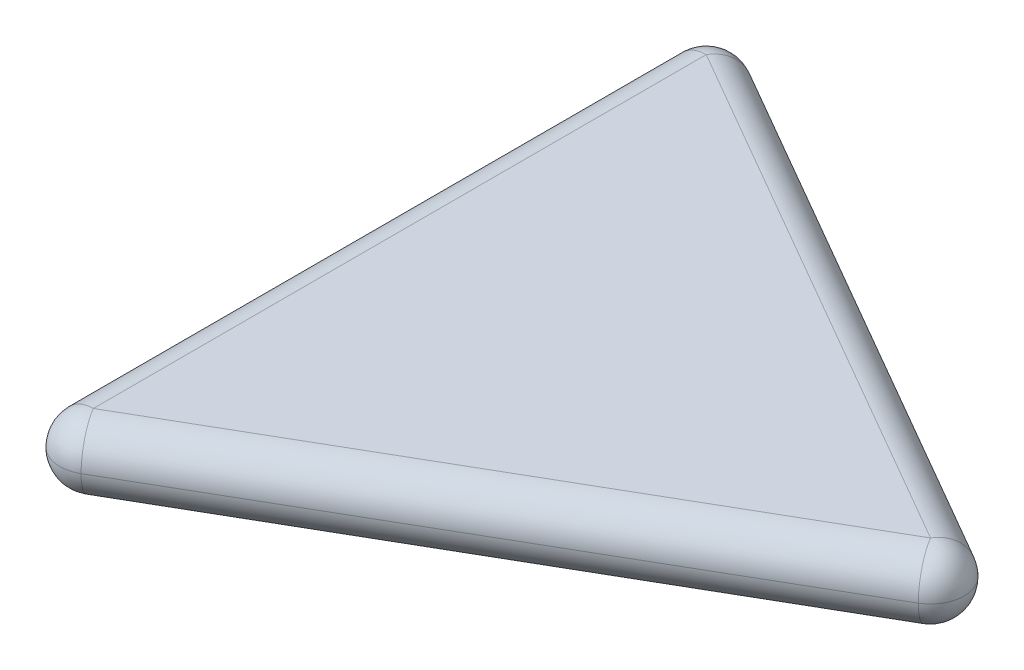
ISO-10303-21;
HEADER;
FILE_DESCRIPTION(('STEP AP214'),'2;1');
FILE_NAME('part.step','',(''),(''),'','','');
FILE_SCHEMA(('AUTOMOTIVE_DESIGN { 1 0 10303 214 1 1 1 1 }'));
ENDSEC;
DATA;
#1=APPLICATION_CONTEXT('core data for automotive mechanical design processes');
#2=APPLICATION_PROTOCOL_DEFINITION('international standard','automotive_design',2000,#1);
#3=PRODUCT_CONTEXT('',#1,'mechanical');
#4=PRODUCT('Part','Part','',(#3));
#5=PRODUCT_RELATED_PRODUCT_CATEGORY('part','',(#4));
#6=PRODUCT_DEFINITION_FORMATION('','',#4);
#7=PRODUCT_DEFINITION_CONTEXT('part definition',#1,'design');
#8=PRODUCT_DEFINITION('design','',#6,#7);
#9=PRODUCT_DEFINITION_SHAPE('','',#8);
#10=(LENGTH_UNIT() NAMED_UNIT(*) SI_UNIT(.MILLI.,.METRE.));
#11=(NAMED_UNIT(*) PLANE_ANGLE_UNIT() SI_UNIT($,.RADIAN.));
#12=(NAMED_UNIT(*) SI_UNIT($,.STERADIAN.) SOLID_ANGLE_UNIT());
#13=UNCERTAINTY_MEASURE_WITH_UNIT(LENGTH_MEASURE(1.E-05),#10,'distance_accuracy_value','');
#14=(GEOMETRIC_REPRESENTATION_CONTEXT(3) GLOBAL_UNCERTAINTY_ASSIGNED_CONTEXT((#13)) GLOBAL_UNIT_ASSIGNED_CONTEXT((#10,
#11,#12)) REPRESENTATION_CONTEXT('',''));
#15=CARTESIAN_POINT('',(0.,0.,0.));
#16=DIRECTION('',(0.,0.,1.));
#17=DIRECTION('',(1.,0.,0.));
#18=AXIS2_PLACEMENT_3D('',#15,#16,#17);
#19=CARTESIAN_POINT('',(-105.470000000001,-20.,-182.679398674289));
#20=DIRECTION('',(0.,1.,0.));
#21=DIRECTION('',(0.,0.,1.));
#22=AXIS2_PLACEMENT_3D('',#19,#20,#21);
#23=PLANE('',#22);
#24=DIRECTION('',(0.866025403784436,0.,-0.500000000000004));
#25=VECTOR('',#24,1.);
#26=CARTESIAN_POINT('',(-105.470000000002,-20.,182.679398674293));
#27=LINE('',#26,#25);
#28=CARTESIAN_POINT('',(210.94,-20.,1.31722944017274E-13));
#29=VERTEX_POINT('',#28);
#30=CARTESIAN_POINT('',(-105.469999999998,-20.,182.679398674291));
#31=VERTEX_POINT('',#30);
#32=EDGE_CURVE('E270',#29,#31,#27,.F.);
#33=ORIENTED_EDGE('',*,*,#32,.T.);
#34=DIRECTION('',(0.,0.,1.));
#35=VECTOR('',#34,1.);
#36=CARTESIAN_POINT('',(-105.470000000002,-20.,-182.679398674293));
#37=LINE('',#36,#35);
#38=CARTESIAN_POINT('',(-105.470000000001,-20.,-182.679398674289));
#39=VERTEX_POINT('',#38);
#40=EDGE_CURVE('E105',#31,#39,#37,.F.);
#41=ORIENTED_EDGE('',*,*,#40,.T.);
#42=DIRECTION('',(-0.86602540378444,0.,-0.499999999999998));
#43=VECTOR('',#42,1.);
#44=CARTESIAN_POINT('',(210.94,-20.,0.));
#45=LINE('',#44,#43);
#46=EDGE_CURVE('E269',#39,#29,#45,.F.);
#47=ORIENTED_EDGE('',*,*,#46,.T.);
#48=EDGE_LOOP('',(#33,#41,#47));
#49=FACE_BOUND('',#48,.T.);
#50=ADVANCED_FACE('F36',(#49),#23,.F.);
#51=CARTESIAN_POINT('',(-105.470000000001,20.,-182.679398674289));
#52=DIRECTION('',(0.,1.,0.));
#53=DIRECTION('',(0.,0.,1.));
#54=AXIS2_PLACEMENT_3D('',#51,#52,#53);
#55=PLANE('',#54);
#56=DIRECTION('',(0.866025403784436,0.,-0.500000000000004));
#57=VECTOR('',#56,1.);
#58=CARTESIAN_POINT('',(52.735000000001,20.,91.3396993371455));
#59=LINE('',#58,#57);
#60=CARTESIAN_POINT('',(-105.469999999998,20.,182.679398674291));
#61=VERTEX_POINT('',#60);
#62=CARTESIAN_POINT('',(210.94,20.,1.90837031853613E-13));
#63=VERTEX_POINT('',#62);
#64=EDGE_CURVE('E46',#61,#63,#59,.T.);
#65=ORIENTED_EDGE('',*,*,#64,.T.);
#66=DIRECTION('',(-0.86602540378444,0.,-0.499999999999998));
#67=VECTOR('',#66,1.);
#68=CARTESIAN_POINT('',(-105.470000000001,20.,-182.679398674289));
#69=LINE('',#68,#67);
#70=CARTESIAN_POINT('',(-105.470000000002,20.,-182.679398674289));
#71=VERTEX_POINT('',#70);
#72=EDGE_CURVE('E11',#63,#71,#69,.T.);
#73=ORIENTED_EDGE('',*,*,#72,.T.);
#74=DIRECTION('',(0.,0.,1.));
#75=VECTOR('',#74,1.);
#76=CARTESIAN_POINT('',(-105.470000000002,20.,-182.679398674289));
#77=LINE('',#76,#75);
#78=EDGE_CURVE('E99',#71,#61,#77,.T.);
#79=ORIENTED_EDGE('',*,*,#78,.T.);
#80=EDGE_LOOP('',(#65,#73,#79));
#81=FACE_BOUND('',#80,.T.);
#82=ADVANCED_FACE('F121',(#81),#55,.T.);
#83=CARTESIAN_POINT('',(210.94,0.,1.42299238792383E-13));
#84=DIRECTION('',(0.,0.,1.));
#85=DIRECTION('',(1.,0.,0.));
#86=AXIS2_PLACEMENT_3D('',#83,#84,#85);
#87=SPHERICAL_SURFACE('',#86,20.);
#88=CARTESIAN_POINT('',(210.94,0.,1.42299238792383E-13));
#89=DIRECTION('',(-0.866025403784446,0.,-0.499999999999987));
#90=DIRECTION('',(-0.499999999999987,0.,0.866025403784446));
#91=AXIS2_PLACEMENT_3D('',#88,#89,#90);
#92=CIRCLE('',#91,20.);
#93=CARTESIAN_POINT('',(220.94,0.,-17.3205080756888));
#94=VERTEX_POINT('',#93);
#95=EDGE_CURVE('E40',#63,#94,#92,.T.);
#96=ORIENTED_EDGE('',*,*,#95,.F.);
#97=CARTESIAN_POINT('',(210.94,0.,1.45716771982052E-13));
#98=DIRECTION('',(-0.866025403784443,0.,0.499999999999992));
#99=DIRECTION('',(0.499999999999992,0.,0.866025403784443));
#100=AXIS2_PLACEMENT_3D('',#97,#98,#99);
#101=CIRCLE('',#100,20.);
#102=CARTESIAN_POINT('',(220.94,0.,17.320508075689));
#103=VERTEX_POINT('',#102);
#104=EDGE_CURVE('E75',#103,#63,#101,.T.);
#105=ORIENTED_EDGE('',*,*,#104,.F.);
#106=CARTESIAN_POINT('',(210.94,0.,1.42299238792383E-13));
#107=DIRECTION('',(0.,1.,0.));
#108=DIRECTION('',(0.,0.,1.));
#109=AXIS2_PLACEMENT_3D('',#106,#107,#108);
#110=CIRCLE('',#109,20.);
#111=EDGE_CURVE('E267',#94,#103,#110,.F.);
#112=ORIENTED_EDGE('',*,*,#111,.F.);
#113=EDGE_LOOP('',(#96,#105,#112));
#114=FACE_BOUND('',#113,.T.);
#115=ADVANCED_FACE('F38',(#114),#87,.T.);
#116=CARTESIAN_POINT('',(-105.470000000001,0.,-182.679398674289));
#117=DIRECTION('',(-0.86602540378444,0.,-0.499999999999998));
#118=DIRECTION('',(-0.499999999999998,0.,0.86602540378444));
#119=AXIS2_PLACEMENT_3D('',#116,#117,#118);
#120=CYLINDRICAL_SURFACE('',#119,20.);
#121=ORIENTED_EDGE('',*,*,#72,.F.);
#122=ORIENTED_EDGE('',*,*,#95,.T.);
#123=DIRECTION('',(-0.86602540378444,0.,-0.499999999999998));
#124=VECTOR('',#123,1.);
#125=CARTESIAN_POINT('',(220.94,0.,-17.3205080756888));
#126=LINE('',#125,#124);
#127=CARTESIAN_POINT('',(-95.4700000000003,0.,-199.999906749978));
#128=VERTEX_POINT('',#127);
#129=EDGE_CURVE('E118',#128,#94,#126,.F.);
#130=ORIENTED_EDGE('',*,*,#129,.F.);
#131=CARTESIAN_POINT('',(-105.470000000001,0.,-182.679398674289));
#132=DIRECTION('',(-0.866025403784433,0.,-0.50000000000001));
#133=DIRECTION('',(-0.50000000000001,0.,0.866025403784433));
#134=AXIS2_PLACEMENT_3D('',#131,#132,#133);
#135=CIRCLE('',#134,20.);
#136=EDGE_CURVE('E111',#71,#128,#135,.T.);
#137=ORIENTED_EDGE('',*,*,#136,.F.);
#138=EDGE_LOOP('',(#121,#122,#130,#137));
#139=FACE_BOUND('',#138,.T.);
#140=ADVANCED_FACE('F116',(#139),#120,.T.);
#141=CARTESIAN_POINT('',(52.7350000000009,0.,91.3396993371454));
#142=DIRECTION('',(0.866025403784436,0.,-0.500000000000004));
#143=DIRECTION('',(-0.500000000000004,0.,-0.866025403784436));
#144=AXIS2_PLACEMENT_3D('',#141,#142,#143);
#145=CYLINDRICAL_SURFACE('',#144,20.);
#146=ORIENTED_EDGE('',*,*,#104,.T.);
#147=ORIENTED_EDGE('',*,*,#64,.F.);
#148=CARTESIAN_POINT('',(-105.470000000002,0.,182.679398674293));
#149=DIRECTION('',(-0.866025403784436,0.,0.500000000000004));
#150=DIRECTION('',(0.500000000000004,0.,0.866025403784436));
#151=AXIS2_PLACEMENT_3D('',#148,#149,#150);
#152=CIRCLE('',#151,20.);
#153=CARTESIAN_POINT('',(-95.4700000000018,0.,199.999906749981));
#154=VERTEX_POINT('',#153);
#155=EDGE_CURVE('E119',#154,#61,#152,.T.);
#156=ORIENTED_EDGE('',*,*,#155,.F.);
#157=DIRECTION('',(0.866025403784436,0.,-0.500000000000004));
#158=VECTOR('',#157,1.);
#159=CARTESIAN_POINT('',(-95.4700000000018,0.,199.999906749981));
#160=LINE('',#159,#158);
#161=EDGE_CURVE('E265',#103,#154,#160,.F.);
#162=ORIENTED_EDGE('',*,*,#161,.F.);
#163=EDGE_LOOP('',(#146,#147,#156,#162));
#164=FACE_BOUND('',#163,.T.);
#165=ADVANCED_FACE('F160',(#164),#145,.T.);
#166=CARTESIAN_POINT('',(210.94,0.,1.42299238792383E-13));
#167=DIRECTION('',(0.,0.,1.));
#168=DIRECTION('',(1.,0.,0.));
#169=AXIS2_PLACEMENT_3D('',#166,#167,#168);
#170=SPHERICAL_SURFACE('',#169,20.);
#171=CARTESIAN_POINT('',(210.94,0.,1.42299238792383E-13));
#172=DIRECTION('',(-0.866025403784443,0.,0.499999999999992));
#173=DIRECTION('',(0.499999999999992,0.,0.866025403784443));
#174=AXIS2_PLACEMENT_3D('',#171,#172,#173);
#175=CIRCLE('',#174,20.);
#176=EDGE_CURVE('E295',#29,#103,#175,.T.);
#177=ORIENTED_EDGE('',*,*,#176,.F.);
#178=CARTESIAN_POINT('',(210.94,0.,1.38777878078145E-13));
#179=DIRECTION('',(-0.866025403784446,0.,-0.499999999999987));
#180=DIRECTION('',(-0.499999999999987,0.,0.866025403784447));
#181=AXIS2_PLACEMENT_3D('',#178,#179,#180);
#182=CIRCLE('',#181,20.);
#183=EDGE_CURVE('E300',#94,#29,#182,.T.);
#184=ORIENTED_EDGE('',*,*,#183,.F.);
#185=ORIENTED_EDGE('',*,*,#111,.T.);
#186=EDGE_LOOP('',(#177,#184,#185));
#187=FACE_BOUND('',#186,.T.);
#188=ADVANCED_FACE('F156',(#187),#170,.T.);
#189=CARTESIAN_POINT('',(210.94,0.,0.));
#190=DIRECTION('',(0.86602540378444,0.,0.499999999999998));
#191=DIRECTION('',(0.499999999999998,0.,-0.86602540378444));
#192=AXIS2_PLACEMENT_3D('',#189,#190,#191);
#193=CYLINDRICAL_SURFACE('',#192,20.);
#194=ORIENTED_EDGE('',*,*,#183,.T.);
#195=ORIENTED_EDGE('',*,*,#46,.F.);
#196=CARTESIAN_POINT('',(-105.470000000001,0.,-182.679398674289));
#197=DIRECTION('',(-0.86602540378444,0.,-0.499999999999998));
#198=DIRECTION('',(-0.499999999999998,0.,0.86602540378444));
#199=AXIS2_PLACEMENT_3D('',#196,#197,#198);
#200=CIRCLE('',#199,20.);
#201=EDGE_CURVE('E293',#128,#39,#200,.T.);
#202=ORIENTED_EDGE('',*,*,#201,.F.);
#203=ORIENTED_EDGE('',*,*,#129,.T.);
#204=EDGE_LOOP('',(#194,#195,#202,#203));
#205=FACE_BOUND('',#204,.T.);
#206=ADVANCED_FACE('F153',(#205),#193,.T.);
#207=CARTESIAN_POINT('',(-105.470000000001,0.,-182.679398674289));
#208=DIRECTION('',(0.,0.,1.));
#209=DIRECTION('',(1.,0.,0.));
#210=AXIS2_PLACEMENT_3D('',#207,#208,#209);
#211=SPHERICAL_SURFACE('',#210,20.);
#212=CARTESIAN_POINT('',(-105.470000000001,0.,-182.679398674289));
#213=DIRECTION('',(-1.9706458687096E-13,0.,1.));
#214=DIRECTION('',(1.,0.,1.9706458687096E-13));
#215=AXIS2_PLACEMENT_3D('',#212,#213,#214);
#216=CIRCLE('',#215,20.);
#217=CARTESIAN_POINT('',(-125.470000000002,0.,-182.679398674293));
#218=VERTEX_POINT('',#217);
#219=EDGE_CURVE('E103',#71,#218,#216,.T.);
#220=ORIENTED_EDGE('',*,*,#219,.F.);
#221=ORIENTED_EDGE('',*,*,#136,.T.);
#222=CARTESIAN_POINT('',(-105.470000000001,0.,-182.679398674289));
#223=DIRECTION('',(0.,1.,0.));
#224=DIRECTION('',(0.,0.,1.));
#225=AXIS2_PLACEMENT_3D('',#222,#223,#224);
#226=CIRCLE('',#225,20.0000000000006);
#227=EDGE_CURVE('E114',#218,#128,#226,.F.);
#228=ORIENTED_EDGE('',*,*,#227,.F.);
#229=EDGE_LOOP('',(#220,#221,#228));
#230=FACE_BOUND('',#229,.T.);
#231=ADVANCED_FACE('F110',(#230),#211,.T.);
#232=CARTESIAN_POINT('',(-105.469999999998,0.,182.679398674291));
#233=DIRECTION('',(0.,0.,1.));
#234=DIRECTION('',(1.,0.,0.));
#235=AXIS2_PLACEMENT_3D('',#232,#233,#234);
#236=SPHERICAL_SURFACE('',#235,20.);
#237=CARTESIAN_POINT('',(-105.469999999998,0.,182.679398674291));
#238=DIRECTION('',(0.,1.,0.));
#239=DIRECTION('',(0.,0.,1.));
#240=AXIS2_PLACEMENT_3D('',#237,#238,#239);
#241=CIRCLE('',#240,20.);
#242=CARTESIAN_POINT('',(-125.469999999998,0.,182.67939867429));
#243=VERTEX_POINT('',#242);
#244=EDGE_CURVE('E288',#154,#243,#241,.F.);
#245=ORIENTED_EDGE('',*,*,#244,.F.);
#246=ORIENTED_EDGE('',*,*,#155,.T.);
#247=CARTESIAN_POINT('',(-105.469999999998,0.,182.679398674291));
#248=DIRECTION('',(0.,0.,-1.));
#249=DIRECTION('',(-1.,0.,0.));
#250=AXIS2_PLACEMENT_3D('',#247,#248,#249);
#251=CIRCLE('',#250,20.);
#252=EDGE_CURVE('E104',#243,#61,#251,.T.);
#253=ORIENTED_EDGE('',*,*,#252,.F.);
#254=EDGE_LOOP('',(#245,#246,#253));
#255=FACE_BOUND('',#254,.T.);
#256=ADVANCED_FACE('F146',(#255),#236,.T.);
#257=CARTESIAN_POINT('',(-105.470000000002,0.,182.679398674293));
#258=DIRECTION('',(-0.866025403784436,0.,0.500000000000004));
#259=DIRECTION('',(0.500000000000004,0.,0.866025403784436));
#260=AXIS2_PLACEMENT_3D('',#257,#258,#259);
#261=CYLINDRICAL_SURFACE('',#260,20.);
#262=ORIENTED_EDGE('',*,*,#176,.T.);
#263=ORIENTED_EDGE('',*,*,#161,.T.);
#264=CARTESIAN_POINT('',(-105.469999999998,0.,182.679398674291));
#265=DIRECTION('',(-0.866025403784542,0.,0.499999999999821));
#266=DIRECTION('',(0.499999999999821,0.,0.866025403784542));
#267=AXIS2_PLACEMENT_3D('',#264,#265,#266);
#268=CIRCLE('',#267,20.);
#269=EDGE_CURVE('E285',#31,#154,#268,.T.);
#270=ORIENTED_EDGE('',*,*,#269,.F.);
#271=ORIENTED_EDGE('',*,*,#32,.F.);
#272=EDGE_LOOP('',(#262,#263,#270,#271));
#273=FACE_BOUND('',#272,.T.);
#274=ADVANCED_FACE('F142',(#273),#261,.T.);
#275=CARTESIAN_POINT('',(-105.470000000001,0.,-182.679398674289));
#276=DIRECTION('',(0.,0.,1.));
#277=DIRECTION('',(1.,0.,0.));
#278=AXIS2_PLACEMENT_3D('',#275,#276,#277);
#279=SPHERICAL_SURFACE('',#278,20.);
#280=ORIENTED_EDGE('',*,*,#227,.T.);
#281=ORIENTED_EDGE('',*,*,#201,.T.);
#282=CARTESIAN_POINT('',(-105.470000000001,0.,-182.679398674289));
#283=DIRECTION('',(-1.97064586870965E-13,0.,1.));
#284=DIRECTION('',(1.,0.,1.97064586870965E-13));
#285=AXIS2_PLACEMENT_3D('',#282,#283,#284);
#286=CIRCLE('',#285,20.);
#287=EDGE_CURVE('E88',#218,#39,#286,.T.);
#288=ORIENTED_EDGE('',*,*,#287,.F.);
#289=EDGE_LOOP('',(#280,#281,#288));
#290=FACE_BOUND('',#289,.T.);
#291=ADVANCED_FACE('F139',(#290),#279,.T.);
#292=CARTESIAN_POINT('',(-105.470000000002,0.,-182.679398674289));
#293=DIRECTION('',(0.,0.,1.));
#294=DIRECTION('',(1.,0.,0.));
#295=AXIS2_PLACEMENT_3D('',#292,#293,#294);
#296=CYLINDRICAL_SURFACE('',#295,20.);
#297=ORIENTED_EDGE('',*,*,#78,.F.);
#298=ORIENTED_EDGE('',*,*,#219,.T.);
#299=DIRECTION('',(0.,0.,1.));
#300=VECTOR('',#299,1.);
#301=CARTESIAN_POINT('',(-125.470000000002,0.,-182.679398674293));
#302=LINE('',#301,#300);
#303=EDGE_CURVE('E282',#243,#218,#302,.F.);
#304=ORIENTED_EDGE('',*,*,#303,.F.);
#305=ORIENTED_EDGE('',*,*,#252,.T.);
#306=EDGE_LOOP('',(#297,#298,#304,#305));
#307=FACE_BOUND('',#306,.T.);
#308=ADVANCED_FACE('F101',(#307),#296,.T.);
#309=CARTESIAN_POINT('',(-105.469999999998,0.,182.679398674291));
#310=DIRECTION('',(0.,0.,1.));
#311=DIRECTION('',(1.,0.,0.));
#312=AXIS2_PLACEMENT_3D('',#309,#310,#311);
#313=SPHERICAL_SURFACE('',#312,20.);
#314=ORIENTED_EDGE('',*,*,#269,.T.);
#315=ORIENTED_EDGE('',*,*,#244,.T.);
#316=CARTESIAN_POINT('',(-105.469999999998,0.,182.679398674291));
#317=DIRECTION('',(0.,0.,-1.));
#318=DIRECTION('',(-1.,0.,0.));
#319=AXIS2_PLACEMENT_3D('',#316,#317,#318);
#320=CIRCLE('',#319,20.);
#321=EDGE_CURVE('E279',#31,#243,#320,.T.);
#322=ORIENTED_EDGE('',*,*,#321,.F.);
#323=EDGE_LOOP('',(#314,#315,#322));
#324=FACE_BOUND('',#323,.T.);
#325=ADVANCED_FACE('F133',(#324),#313,.T.);
#326=CARTESIAN_POINT('',(-105.470000000002,0.,-182.679398674293));
#327=DIRECTION('',(0.,0.,-1.));
#328=DIRECTION('',(-1.,0.,0.));
#329=AXIS2_PLACEMENT_3D('',#326,#327,#328);
#330=CYLINDRICAL_SURFACE('',#329,20.);
#331=ORIENTED_EDGE('',*,*,#287,.T.);
#332=ORIENTED_EDGE('',*,*,#40,.F.);
#333=ORIENTED_EDGE('',*,*,#321,.T.);
#334=ORIENTED_EDGE('',*,*,#303,.T.);
#335=EDGE_LOOP('',(#331,#332,#333,#334));
#336=FACE_BOUND('',#335,.T.);
#337=ADVANCED_FACE('F130',(#336),#330,.T.);
#338=CLOSED_SHELL('',(#50,#82,#115,#140,#165,#188,#206,#231,#256,#274,#291,#308,#325,#337));
#339=MANIFOLD_SOLID_BREP('B2',#338);
#340=ADVANCED_BREP_SHAPE_REPRESENTATION('',(#18,#339),#14);
#341=SHAPE_DEFINITION_REPRESENTATION(#9,#340);
ENDSEC;
END-ISO-10303-21;
